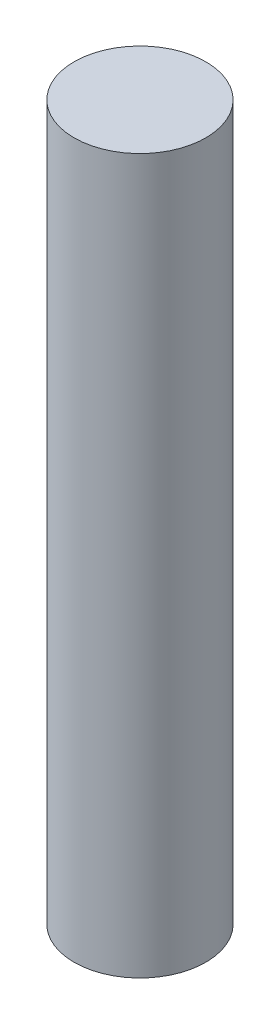
ISO-10303-21;
HEADER;
FILE_DESCRIPTION(('STEP AP214'),'2;1');
FILE_NAME('part.step','',(''),(''),'','','');
FILE_SCHEMA(('AUTOMOTIVE_DESIGN { 1 0 10303 214 1 1 1 1 }'));
ENDSEC;
DATA;
#1=APPLICATION_CONTEXT('core data for automotive mechanical design processes');
#2=APPLICATION_PROTOCOL_DEFINITION('international standard','automotive_design',2000,#1);
#3=PRODUCT_CONTEXT('',#1,'mechanical');
#4=PRODUCT('Part','Part','',(#3));
#5=PRODUCT_RELATED_PRODUCT_CATEGORY('part','',(#4));
#6=PRODUCT_DEFINITION_FORMATION('','',#4);
#7=PRODUCT_DEFINITION_CONTEXT('part definition',#1,'design');
#8=PRODUCT_DEFINITION('design','',#6,#7);
#9=PRODUCT_DEFINITION_SHAPE('','',#8);
#10=(LENGTH_UNIT() NAMED_UNIT(*) SI_UNIT(.MILLI.,.METRE.));
#11=(NAMED_UNIT(*) PLANE_ANGLE_UNIT() SI_UNIT($,.RADIAN.));
#12=(NAMED_UNIT(*) SI_UNIT($,.STERADIAN.) SOLID_ANGLE_UNIT());
#13=UNCERTAINTY_MEASURE_WITH_UNIT(LENGTH_MEASURE(1.E-05),#10,'distance_accuracy_value','');
#14=(GEOMETRIC_REPRESENTATION_CONTEXT(3) GLOBAL_UNCERTAINTY_ASSIGNED_CONTEXT((#13)) GLOBAL_UNIT_ASSIGNED_CONTEXT((#10,
#11,#12)) REPRESENTATION_CONTEXT('',''));
#15=CARTESIAN_POINT('',(0.,0.,0.));
#16=DIRECTION('',(0.,0.,1.));
#17=DIRECTION('',(1.,0.,0.));
#18=AXIS2_PLACEMENT_3D('',#15,#16,#17);
#19=CARTESIAN_POINT('',(0.,20.86,-45.445));
#20=DIRECTION('',(0.,-1.,0.));
#21=DIRECTION('',(0.,0.,-1.));
#22=AXIS2_PLACEMENT_3D('',#19,#20,#21);
#23=CYLINDRICAL_SURFACE('',#22,1.925);
#24=CARTESIAN_POINT('',(0.,20.86,-45.445));
#25=DIRECTION('',(0.,1.,0.));
#26=DIRECTION('',(0.,0.,1.));
#27=AXIS2_PLACEMENT_3D('',#24,#25,#26);
#28=CIRCLE('',#27,1.925);
#29=CARTESIAN_POINT('',(0.,20.86,-43.52));
#30=VERTEX_POINT('',#29);
#31=EDGE_CURVE('E10',#30,#30,#28,.T.);
#32=ORIENTED_EDGE('',*,*,#31,.F.);
#33=EDGE_LOOP('',(#32));
#34=FACE_BOUND('',#33,.T.);
#35=CARTESIAN_POINT('',(0.,0.,-45.445));
#36=DIRECTION('',(0.,1.,0.));
#37=DIRECTION('',(0.,0.,1.));
#38=AXIS2_PLACEMENT_3D('',#35,#36,#37);
#39=CIRCLE('',#38,1.925);
#40=CARTESIAN_POINT('',(0.,0.,-43.52));
#41=VERTEX_POINT('',#40);
#42=EDGE_CURVE('E36',#41,#41,#39,.T.);
#43=ORIENTED_EDGE('',*,*,#42,.T.);
#44=EDGE_LOOP('',(#43));
#45=FACE_BOUND('',#44,.T.);
#46=ADVANCED_FACE('F33',(#34,#45),#23,.T.);
#47=CARTESIAN_POINT('',(0.,20.86,-45.445));
#48=DIRECTION('',(0.,1.,0.));
#49=DIRECTION('',(0.,0.,1.));
#50=AXIS2_PLACEMENT_3D('',#47,#48,#49);
#51=PLANE('',#50);
#52=ORIENTED_EDGE('',*,*,#31,.T.);
#53=EDGE_LOOP('',(#52));
#54=FACE_BOUND('',#53,.T.);
#55=ADVANCED_FACE('F48',(#54),#51,.T.);
#56=CARTESIAN_POINT('',(0.,0.,-45.445));
#57=DIRECTION('',(0.,1.,0.));
#58=DIRECTION('',(0.,0.,1.));
#59=AXIS2_PLACEMENT_3D('',#56,#57,#58);
#60=PLANE('',#59);
#61=ORIENTED_EDGE('',*,*,#42,.F.);
#62=EDGE_LOOP('',(#61));
#63=FACE_BOUND('',#62,.T.);
#64=ADVANCED_FACE('F46',(#63),#60,.F.);
#65=CLOSED_SHELL('',(#46,#55,#64));
#66=MANIFOLD_SOLID_BREP('B2',#65);
#67=ADVANCED_BREP_SHAPE_REPRESENTATION('',(#18,#66),#14);
#68=SHAPE_DEFINITION_REPRESENTATION(#9,#67);
ENDSEC;
END-ISO-10303-21;
